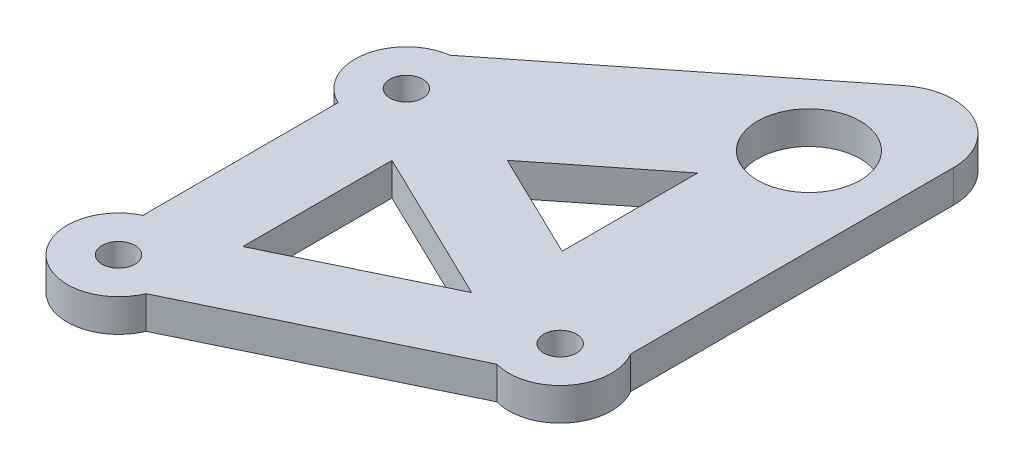
ISO-10303-21;
HEADER;
FILE_DESCRIPTION(('STEP AP214'),'2;1');
FILE_NAME('part.step','',(''),(''),'','','');
FILE_SCHEMA(('AUTOMOTIVE_DESIGN { 1 0 10303 214 1 1 1 1 }'));
ENDSEC;
DATA;
#1=APPLICATION_CONTEXT('core data for automotive mechanical design processes');
#2=APPLICATION_PROTOCOL_DEFINITION('international standard','automotive_design',2000,#1);
#3=PRODUCT_CONTEXT('',#1,'mechanical');
#4=PRODUCT('Part','Part','',(#3));
#5=PRODUCT_RELATED_PRODUCT_CATEGORY('part','',(#4));
#6=PRODUCT_DEFINITION_FORMATION('','',#4);
#7=PRODUCT_DEFINITION_CONTEXT('part definition',#1,'design');
#8=PRODUCT_DEFINITION('design','',#6,#7);
#9=PRODUCT_DEFINITION_SHAPE('','',#8);
#10=(LENGTH_UNIT() NAMED_UNIT(*) SI_UNIT(.MILLI.,.METRE.));
#11=(NAMED_UNIT(*) PLANE_ANGLE_UNIT() SI_UNIT($,.RADIAN.));
#12=(NAMED_UNIT(*) SI_UNIT($,.STERADIAN.) SOLID_ANGLE_UNIT());
#13=UNCERTAINTY_MEASURE_WITH_UNIT(LENGTH_MEASURE(1.E-05),#10,'distance_accuracy_value','');
#14=(GEOMETRIC_REPRESENTATION_CONTEXT(3) GLOBAL_UNCERTAINTY_ASSIGNED_CONTEXT((#13)) GLOBAL_UNIT_ASSIGNED_CONTEXT((#10,
#11,#12)) REPRESENTATION_CONTEXT('',''));
#15=CARTESIAN_POINT('',(0.,0.,0.));
#16=DIRECTION('',(0.,0.,1.));
#17=DIRECTION('',(1.,0.,0.));
#18=AXIS2_PLACEMENT_3D('',#15,#16,#17);
#19=CARTESIAN_POINT('',(-14.5,0.,-14.02));
#20=DIRECTION('',(0.,1.,0.));
#21=DIRECTION('',(0.,0.,1.));
#22=AXIS2_PLACEMENT_3D('',#19,#20,#21);
#23=PLANE('',#22);
#24=CARTESIAN_POINT('',(14.5,0.,0.));
#25=DIRECTION('',(0.,1.,0.));
#26=DIRECTION('',(0.,0.,1.));
#27=AXIS2_PLACEMENT_3D('',#24,#25,#26);
#28=CIRCLE('',#27,1.6);
#29=CARTESIAN_POINT('',(14.5,0.,1.6));
#30=VERTEX_POINT('',#29);
#31=EDGE_CURVE('E402',#30,#30,#28,.T.);
#32=ORIENTED_EDGE('',*,*,#31,.T.);
#33=EDGE_LOOP('',(#32));
#34=FACE_BOUND('',#33,.T.);
#35=CARTESIAN_POINT('',(-14.5,0.,14.02));
#36=DIRECTION('',(0.,1.,0.));
#37=DIRECTION('',(0.,0.,1.));
#38=AXIS2_PLACEMENT_3D('',#35,#36,#37);
#39=CIRCLE('',#38,1.6);
#40=CARTESIAN_POINT('',(-14.5,0.,15.62));
#41=VERTEX_POINT('',#40);
#42=EDGE_CURVE('E412',#41,#41,#39,.T.);
#43=ORIENTED_EDGE('',*,*,#42,.T.);
#44=EDGE_LOOP('',(#43));
#45=FACE_BOUND('',#44,.T.);
#46=CARTESIAN_POINT('',(-14.5,0.,-14.02));
#47=DIRECTION('',(0.,1.,0.));
#48=DIRECTION('',(0.,0.,1.));
#49=AXIS2_PLACEMENT_3D('',#46,#47,#48);
#50=CIRCLE('',#49,1.6);
#51=CARTESIAN_POINT('',(-14.5,0.,-12.42));
#52=VERTEX_POINT('',#51);
#53=EDGE_CURVE('E170',#52,#52,#50,.T.);
#54=ORIENTED_EDGE('',*,*,#53,.T.);
#55=EDGE_LOOP('',(#54));
#56=FACE_BOUND('',#55,.T.);
#57=DIRECTION('',(0.,0.,1.));
#58=VECTOR('',#57,1.);
#59=CARTESIAN_POINT('',(-9.148706396828,0.,7.26768697275068));
#60=LINE('',#59,#58);
#61=CARTESIAN_POINT('',(-9.148706396828,0.,-7.26768697275068));
#62=VERTEX_POINT('',#61);
#63=CARTESIAN_POINT('',(-9.148706396828,0.,7.26768697275068));
#64=VERTEX_POINT('',#63);
#65=EDGE_CURVE('E158',#62,#64,#60,.T.);
#66=ORIENTED_EDGE('',*,*,#65,.T.);
#67=DIRECTION('',(0.900308403633243,0.,-0.435252545480623));
#68=VECTOR('',#67,1.);
#69=CARTESIAN_POINT('',(-9.148706396828,0.,7.26768697275068));
#70=LINE('',#69,#68);
#71=CARTESIAN_POINT('',(5.88431230572332,0.,0.));
#72=VERTEX_POINT('',#71);
#73=EDGE_CURVE('E195',#64,#72,#70,.T.);
#74=ORIENTED_EDGE('',*,*,#73,.T.);
#75=DIRECTION('',(-0.900308403633243,0.,-0.435252545480623));
#76=VECTOR('',#75,1.);
#77=CARTESIAN_POINT('',(-9.148706396828,0.,-7.26768697275068));
#78=LINE('',#77,#76);
#79=EDGE_CURVE('E184',#72,#62,#78,.T.);
#80=ORIENTED_EDGE('',*,*,#79,.T.);
#81=EDGE_LOOP('',(#66,#74,#80));
#82=FACE_BOUND('',#81,.T.);
#83=CARTESIAN_POINT('',(-14.5,0.,-14.02));
#84=DIRECTION('',(0.,1.,0.));
#85=DIRECTION('',(0.,0.,1.));
#86=AXIS2_PLACEMENT_3D('',#83,#84,#85);
#87=CIRCLE('',#86,5.);
#88=CARTESIAN_POINT('',(-15.1859355739881,0.,-18.9727257533946));
#89=VERTEX_POINT('',#88);
#90=CARTESIAN_POINT('',(-16.648706396828,0.,-9.50523967189504));
#91=VERTEX_POINT('',#90);
#92=EDGE_CURVE('E212',#89,#91,#87,.T.);
#93=ORIENTED_EDGE('',*,*,#92,.F.);
#94=DIRECTION('',(-0.78372304879793,0.,0.621110443305276));
#95=VECTOR('',#94,1.);
#96=CARTESIAN_POINT('',(-15.1859355739881,0.,-18.9727257533946));
#97=LINE('',#96,#95);
#98=CARTESIAN_POINT('',(9.48849844955789,0.,-38.5275272590765));
#99=VERTEX_POINT('',#98);
#100=EDGE_CURVE('E218',#99,#89,#97,.T.);
#101=ORIENTED_EDGE('',*,*,#100,.F.);
#102=CARTESIAN_POINT('',(13.0590113124706,0.,-34.0222202611731));
#103=DIRECTION('',(0.,1.,0.));
#104=DIRECTION('',(0.,0.,-1.));
#105=AXIS2_PLACEMENT_3D('',#102,#103,#104);
#106=CIRCLE('',#105,5.74859576327843);
#107=CARTESIAN_POINT('',(18.807607075749,0.,-34.0222202611731));
#108=VERTEX_POINT('',#107);
#109=EDGE_CURVE('E258',#108,#99,#106,.T.);
#110=ORIENTED_EDGE('',*,*,#109,.F.);
#111=DIRECTION('',(0.,0.,-1.));
#112=VECTOR('',#111,1.);
#113=CARTESIAN_POINT('',(18.807607075749,0.,-2.53860616893544));
#114=LINE('',#113,#112);
#115=CARTESIAN_POINT('',(18.807607075749,0.,-2.53860616893544));
#116=VERTEX_POINT('',#115);
#117=EDGE_CURVE('E255',#116,#108,#114,.T.);
#118=ORIENTED_EDGE('',*,*,#117,.F.);
#119=CARTESIAN_POINT('',(14.5,0.,0.));
#120=DIRECTION('',(0.,1.,0.));
#121=DIRECTION('',(0.,0.,1.));
#122=AXIS2_PLACEMENT_3D('',#119,#120,#121);
#123=CIRCLE('',#122,5.);
#124=CARTESIAN_POINT('',(13.1547068714584,0.,4.81561900468661));
#125=VERTEX_POINT('',#124);
#126=EDGE_CURVE('E252',#125,#116,#123,.T.);
#127=ORIENTED_EDGE('',*,*,#126,.F.);
#128=DIRECTION('',(0.900308403633243,0.,-0.435252545480623));
#129=VECTOR('',#128,1.);
#130=CARTESIAN_POINT('',(13.1547068714584,0.,4.81561900468661));
#131=LINE('',#130,#129);
#132=CARTESIAN_POINT('',(-9.89031278035376,0.,15.9566940225627));
#133=VERTEX_POINT('',#132);
#134=EDGE_CURVE('E249',#133,#125,#131,.T.);
#135=ORIENTED_EDGE('',*,*,#134,.F.);
#136=CARTESIAN_POINT('',(-14.5,0.,14.02));
#137=DIRECTION('',(0.,1.,0.));
#138=DIRECTION('',(0.,0.,1.));
#139=AXIS2_PLACEMENT_3D('',#136,#137,#138);
#140=CIRCLE('',#139,5.);
#141=CARTESIAN_POINT('',(-16.648706396828,0.,9.50523967189503));
#142=VERTEX_POINT('',#141);
#143=EDGE_CURVE('E246',#142,#133,#140,.T.);
#144=ORIENTED_EDGE('',*,*,#143,.F.);
#145=DIRECTION('',(0.,0.,1.));
#146=VECTOR('',#145,1.);
#147=CARTESIAN_POINT('',(-16.648706396828,0.,9.50523967189504));
#148=LINE('',#147,#146);
#149=EDGE_CURVE('E243',#91,#142,#148,.T.);
#150=ORIENTED_EDGE('',*,*,#149,.F.);
#151=EDGE_LOOP('',(#93,#101,#110,#118,#127,#135,#144,#150));
#152=FACE_BOUND('',#151,.T.);
#153=DIRECTION('',(-0.78372304879793,0.,0.621110443305277));
#154=VECTOR('',#153,1.);
#155=CARTESIAN_POINT('',(-3.54321298464433,0.,-12.8881995696025));
#156=LINE('',#155,#154);
#157=CARTESIAN_POINT('',(6.80760707574901,0.,-21.0913555775122));
#158=VERTEX_POINT('',#157);
#159=CARTESIAN_POINT('',(-3.54321298464433,0.,-12.8881995696025));
#160=VERTEX_POINT('',#159);
#161=EDGE_CURVE('E63',#158,#160,#156,.T.);
#162=ORIENTED_EDGE('',*,*,#161,.T.);
#163=DIRECTION('',(0.900308403633243,0.,0.435252545480623));
#164=VECTOR('',#163,1.);
#165=CARTESIAN_POINT('',(-3.54321298464433,0.,-12.8881995696025));
#166=LINE('',#165,#164);
#167=CARTESIAN_POINT('',(6.80760707574901,0.,-7.88411345764682));
#168=VERTEX_POINT('',#167);
#169=EDGE_CURVE('E156',#160,#168,#166,.T.);
#170=ORIENTED_EDGE('',*,*,#169,.T.);
#171=DIRECTION('',(0.,0.,-1.));
#172=VECTOR('',#171,1.);
#173=CARTESIAN_POINT('',(6.80760707574901,0.,-7.88411345764682));
#174=LINE('',#173,#172);
#175=EDGE_CURVE('E151',#168,#158,#174,.T.);
#176=ORIENTED_EDGE('',*,*,#175,.T.);
#177=EDGE_LOOP('',(#162,#170,#176));
#178=FACE_BOUND('',#177,.T.);
#179=CARTESIAN_POINT('',(10.3380717056092,0.,-28.3940284923442));
#180=DIRECTION('',(0.,-1.,0.));
#181=DIRECTION('',(0.,0.,-1.));
#182=AXIS2_PLACEMENT_3D('',#179,#180,#181);
#183=CIRCLE('',#182,5.);
#184=CARTESIAN_POINT('',(10.3380717056092,0.,-33.3940284923442));
#185=VERTEX_POINT('',#184);
#186=EDGE_CURVE('E392',#185,#185,#183,.T.);
#187=ORIENTED_EDGE('',*,*,#186,.F.);
#188=EDGE_LOOP('',(#187));
#189=FACE_BOUND('',#188,.T.);
#190=ADVANCED_FACE('F39',(#34,#45,#56,#82,#152,#178,#189),#23,.F.);
#191=CARTESIAN_POINT('',(-14.5,3.18,-14.02));
#192=DIRECTION('',(0.,1.,0.));
#193=DIRECTION('',(0.,0.,1.));
#194=AXIS2_PLACEMENT_3D('',#191,#192,#193);
#195=PLANE('',#194);
#196=CARTESIAN_POINT('',(10.3380717056092,3.18,-28.3940284923442));
#197=DIRECTION('',(0.,1.,0.));
#198=DIRECTION('',(0.,0.,1.));
#199=AXIS2_PLACEMENT_3D('',#196,#197,#198);
#200=CIRCLE('',#199,5.);
#201=CARTESIAN_POINT('',(10.3380717056092,3.18,-23.3940284923442));
#202=VERTEX_POINT('',#201);
#203=EDGE_CURVE('E395',#202,#202,#200,.T.);
#204=ORIENTED_EDGE('',*,*,#203,.F.);
#205=EDGE_LOOP('',(#204));
#206=FACE_BOUND('',#205,.T.);
#207=CARTESIAN_POINT('',(14.5,3.18,0.));
#208=DIRECTION('',(0.,1.,0.));
#209=DIRECTION('',(0.,0.,1.));
#210=AXIS2_PLACEMENT_3D('',#207,#208,#209);
#211=CIRCLE('',#210,1.6);
#212=CARTESIAN_POINT('',(14.5,3.18,1.6));
#213=VERTEX_POINT('',#212);
#214=EDGE_CURVE('E397',#213,#213,#211,.T.);
#215=ORIENTED_EDGE('',*,*,#214,.F.);
#216=EDGE_LOOP('',(#215));
#217=FACE_BOUND('',#216,.T.);
#218=CARTESIAN_POINT('',(-14.5,3.18,14.02));
#219=DIRECTION('',(0.,1.,0.));
#220=DIRECTION('',(0.,0.,1.));
#221=AXIS2_PLACEMENT_3D('',#218,#219,#220);
#222=CIRCLE('',#221,1.6);
#223=CARTESIAN_POINT('',(-14.5,3.18,15.62));
#224=VERTEX_POINT('',#223);
#225=EDGE_CURVE('E408',#224,#224,#222,.T.);
#226=ORIENTED_EDGE('',*,*,#225,.F.);
#227=EDGE_LOOP('',(#226));
#228=FACE_BOUND('',#227,.T.);
#229=CARTESIAN_POINT('',(-14.5,3.18,-14.02));
#230=DIRECTION('',(0.,1.,0.));
#231=DIRECTION('',(0.,0.,1.));
#232=AXIS2_PLACEMENT_3D('',#229,#230,#231);
#233=CIRCLE('',#232,1.6);
#234=CARTESIAN_POINT('',(-14.5,3.18,-12.42));
#235=VERTEX_POINT('',#234);
#236=EDGE_CURVE('E416',#235,#235,#233,.T.);
#237=ORIENTED_EDGE('',*,*,#236,.F.);
#238=EDGE_LOOP('',(#237));
#239=FACE_BOUND('',#238,.T.);
#240=CARTESIAN_POINT('',(-14.5,3.18,-14.02));
#241=DIRECTION('',(0.,1.,0.));
#242=DIRECTION('',(0.,0.,1.));
#243=AXIS2_PLACEMENT_3D('',#240,#241,#242);
#244=CIRCLE('',#243,5.);
#245=CARTESIAN_POINT('',(-15.1859355739881,3.18,-18.9727257533946));
#246=VERTEX_POINT('',#245);
#247=CARTESIAN_POINT('',(-16.648706396828,3.18,-9.50523967189504));
#248=VERTEX_POINT('',#247);
#249=EDGE_CURVE('E213',#246,#248,#244,.T.);
#250=ORIENTED_EDGE('',*,*,#249,.T.);
#251=DIRECTION('',(0.,0.,1.));
#252=VECTOR('',#251,1.);
#253=CARTESIAN_POINT('',(-16.648706396828,3.18,9.50523967189504));
#254=LINE('',#253,#252);
#255=CARTESIAN_POINT('',(-16.648706396828,3.18,9.50523967189503));
#256=VERTEX_POINT('',#255);
#257=EDGE_CURVE('E217',#248,#256,#254,.T.);
#258=ORIENTED_EDGE('',*,*,#257,.T.);
#259=CARTESIAN_POINT('',(-14.5,3.18,14.02));
#260=DIRECTION('',(0.,1.,0.));
#261=DIRECTION('',(0.,0.,1.));
#262=AXIS2_PLACEMENT_3D('',#259,#260,#261);
#263=CIRCLE('',#262,5.);
#264=CARTESIAN_POINT('',(-9.89031278035376,3.18,15.9566940225627));
#265=VERTEX_POINT('',#264);
#266=EDGE_CURVE('E221',#256,#265,#263,.T.);
#267=ORIENTED_EDGE('',*,*,#266,.T.);
#268=DIRECTION('',(0.900308403633243,0.,-0.435252545480623));
#269=VECTOR('',#268,1.);
#270=CARTESIAN_POINT('',(13.1547068714584,3.18,4.81561900468661));
#271=LINE('',#270,#269);
#272=CARTESIAN_POINT('',(13.1547068714584,3.18,4.81561900468661));
#273=VERTEX_POINT('',#272);
#274=EDGE_CURVE('E224',#265,#273,#271,.T.);
#275=ORIENTED_EDGE('',*,*,#274,.T.);
#276=CARTESIAN_POINT('',(14.5,3.18,0.));
#277=DIRECTION('',(0.,1.,0.));
#278=DIRECTION('',(0.,0.,1.));
#279=AXIS2_PLACEMENT_3D('',#276,#277,#278);
#280=CIRCLE('',#279,5.);
#281=CARTESIAN_POINT('',(18.807607075749,3.18,-2.53860616893544));
#282=VERTEX_POINT('',#281);
#283=EDGE_CURVE('E227',#273,#282,#280,.T.);
#284=ORIENTED_EDGE('',*,*,#283,.T.);
#285=DIRECTION('',(0.,0.,-1.));
#286=VECTOR('',#285,1.);
#287=CARTESIAN_POINT('',(18.807607075749,3.18,-2.53860616893544));
#288=LINE('',#287,#286);
#289=CARTESIAN_POINT('',(18.807607075749,3.18,-34.0222202611731));
#290=VERTEX_POINT('',#289);
#291=EDGE_CURVE('E230',#282,#290,#288,.T.);
#292=ORIENTED_EDGE('',*,*,#291,.T.);
#293=CARTESIAN_POINT('',(13.0590113124706,3.18,-34.0222202611731));
#294=DIRECTION('',(0.,1.,0.));
#295=DIRECTION('',(0.,0.,-1.));
#296=AXIS2_PLACEMENT_3D('',#293,#294,#295);
#297=CIRCLE('',#296,5.74859576327843);
#298=CARTESIAN_POINT('',(9.48849844955789,3.18,-38.5275272590765));
#299=VERTEX_POINT('',#298);
#300=EDGE_CURVE('E233',#290,#299,#297,.T.);
#301=ORIENTED_EDGE('',*,*,#300,.T.);
#302=DIRECTION('',(-0.78372304879793,0.,0.621110443305276));
#303=VECTOR('',#302,1.);
#304=CARTESIAN_POINT('',(-15.1859355739881,3.18,-18.9727257533946));
#305=LINE('',#304,#303);
#306=EDGE_CURVE('E236',#299,#246,#305,.T.);
#307=ORIENTED_EDGE('',*,*,#306,.T.);
#308=EDGE_LOOP('',(#250,#258,#267,#275,#284,#292,#301,#307));
#309=FACE_BOUND('',#308,.T.);
#310=DIRECTION('',(0.900308403633243,0.,-0.435252545480623));
#311=VECTOR('',#310,1.);
#312=CARTESIAN_POINT('',(-9.148706396828,3.18,7.26768697275068));
#313=LINE('',#312,#311);
#314=CARTESIAN_POINT('',(-9.148706396828,3.18,7.26768697275068));
#315=VERTEX_POINT('',#314);
#316=CARTESIAN_POINT('',(5.88431230572332,3.18,0.));
#317=VERTEX_POINT('',#316);
#318=EDGE_CURVE('E183',#315,#317,#313,.T.);
#319=ORIENTED_EDGE('',*,*,#318,.F.);
#320=DIRECTION('',(0.,0.,1.));
#321=VECTOR('',#320,1.);
#322=CARTESIAN_POINT('',(-9.148706396828,3.18,7.26768697275068));
#323=LINE('',#322,#321);
#324=CARTESIAN_POINT('',(-9.148706396828,3.18,-7.26768697275068));
#325=VERTEX_POINT('',#324);
#326=EDGE_CURVE('E180',#325,#315,#323,.T.);
#327=ORIENTED_EDGE('',*,*,#326,.F.);
#328=DIRECTION('',(-0.900308403633243,0.,-0.435252545480623));
#329=VECTOR('',#328,1.);
#330=CARTESIAN_POINT('',(-9.148706396828,3.18,-7.26768697275068));
#331=LINE('',#330,#329);
#332=EDGE_CURVE('E188',#317,#325,#331,.T.);
#333=ORIENTED_EDGE('',*,*,#332,.F.);
#334=EDGE_LOOP('',(#319,#327,#333));
#335=FACE_BOUND('',#334,.T.);
#336=DIRECTION('',(0.900308403633243,0.,0.435252545480623));
#337=VECTOR('',#336,1.);
#338=CARTESIAN_POINT('',(-3.54321298464433,3.18,-12.8881995696025));
#339=LINE('',#338,#337);
#340=CARTESIAN_POINT('',(-3.54321298464433,3.18,-12.8881995696025));
#341=VERTEX_POINT('',#340);
#342=CARTESIAN_POINT('',(6.80760707574901,3.18,-7.88411345764682));
#343=VERTEX_POINT('',#342);
#344=EDGE_CURVE('E150',#341,#343,#339,.T.);
#345=ORIENTED_EDGE('',*,*,#344,.F.);
#346=DIRECTION('',(-0.78372304879793,0.,0.621110443305277));
#347=VECTOR('',#346,1.);
#348=CARTESIAN_POINT('',(-3.54321298464433,3.18,-12.8881995696025));
#349=LINE('',#348,#347);
#350=CARTESIAN_POINT('',(6.80760707574901,3.18,-21.0913555775122));
#351=VERTEX_POINT('',#350);
#352=EDGE_CURVE('E141',#351,#341,#349,.T.);
#353=ORIENTED_EDGE('',*,*,#352,.F.);
#354=DIRECTION('',(0.,0.,-1.));
#355=VECTOR('',#354,1.);
#356=CARTESIAN_POINT('',(6.80760707574901,3.18,-7.88411345764682));
#357=LINE('',#356,#355);
#358=EDGE_CURVE('E161',#343,#351,#357,.T.);
#359=ORIENTED_EDGE('',*,*,#358,.F.);
#360=EDGE_LOOP('',(#345,#353,#359));
#361=FACE_BOUND('',#360,.T.);
#362=ADVANCED_FACE('F160',(#206,#217,#228,#239,#309,#335,#361),#195,.T.);
#363=CARTESIAN_POINT('',(-14.5,3.18,-14.02));
#364=DIRECTION('',(0.,-1.,0.));
#365=DIRECTION('',(0.,0.,-1.));
#366=AXIS2_PLACEMENT_3D('',#363,#364,#365);
#367=CYLINDRICAL_SURFACE('',#366,5.);
#368=ORIENTED_EDGE('',*,*,#92,.T.);
#369=DIRECTION('',(0.,-1.,0.));
#370=VECTOR('',#369,1.);
#371=CARTESIAN_POINT('',(-16.648706396828,3.18,-9.50523967189504));
#372=LINE('',#371,#370);
#373=EDGE_CURVE('E11',#248,#91,#372,.T.);
#374=ORIENTED_EDGE('',*,*,#373,.F.);
#375=ORIENTED_EDGE('',*,*,#249,.F.);
#376=DIRECTION('',(0.,-1.,0.));
#377=VECTOR('',#376,1.);
#378=CARTESIAN_POINT('',(-15.1859355739881,3.18,-18.9727257533946));
#379=LINE('',#378,#377);
#380=EDGE_CURVE('E239',#246,#89,#379,.T.);
#381=ORIENTED_EDGE('',*,*,#380,.T.);
#382=EDGE_LOOP('',(#368,#374,#375,#381));
#383=FACE_BOUND('',#382,.T.);
#384=ADVANCED_FACE('F41',(#383),#367,.T.);
#385=CARTESIAN_POINT('',(-16.648706396828,3.18,9.50523967189504));
#386=DIRECTION('',(1.,0.,0.));
#387=DIRECTION('',(0.,0.,-1.));
#388=AXIS2_PLACEMENT_3D('',#385,#386,#387);
#389=PLANE('',#388);
#390=ORIENTED_EDGE('',*,*,#149,.T.);
#391=DIRECTION('',(0.,-1.,0.));
#392=VECTOR('',#391,1.);
#393=CARTESIAN_POINT('',(-16.648706396828,3.18,9.50523967189503));
#394=LINE('',#393,#392);
#395=EDGE_CURVE('E48',#256,#142,#394,.T.);
#396=ORIENTED_EDGE('',*,*,#395,.F.);
#397=ORIENTED_EDGE('',*,*,#257,.F.);
#398=ORIENTED_EDGE('',*,*,#373,.T.);
#399=EDGE_LOOP('',(#390,#396,#397,#398));
#400=FACE_BOUND('',#399,.T.);
#401=ADVANCED_FACE('F314',(#400),#389,.F.);
#402=CARTESIAN_POINT('',(-14.5,3.18,14.02));
#403=DIRECTION('',(0.,-1.,0.));
#404=DIRECTION('',(0.,0.,-1.));
#405=AXIS2_PLACEMENT_3D('',#402,#403,#404);
#406=CYLINDRICAL_SURFACE('',#405,5.);
#407=ORIENTED_EDGE('',*,*,#143,.T.);
#408=DIRECTION('',(0.,-1.,0.));
#409=VECTOR('',#408,1.);
#410=CARTESIAN_POINT('',(-9.89031278035376,3.18,15.9566940225627));
#411=LINE('',#410,#409);
#412=EDGE_CURVE('E282',#265,#133,#411,.T.);
#413=ORIENTED_EDGE('',*,*,#412,.F.);
#414=ORIENTED_EDGE('',*,*,#266,.F.);
#415=ORIENTED_EDGE('',*,*,#395,.T.);
#416=EDGE_LOOP('',(#407,#413,#414,#415));
#417=FACE_BOUND('',#416,.T.);
#418=ADVANCED_FACE('F291',(#417),#406,.T.);
#419=CARTESIAN_POINT('',(13.1547068714584,3.18,4.81561900468661));
#420=DIRECTION('',(-0.435252545480623,0.,-0.900308403633243));
#421=DIRECTION('',(-0.900308403633243,0.,0.435252545480623));
#422=AXIS2_PLACEMENT_3D('',#419,#420,#421);
#423=PLANE('',#422);
#424=ORIENTED_EDGE('',*,*,#134,.T.);
#425=DIRECTION('',(0.,-1.,0.));
#426=VECTOR('',#425,1.);
#427=CARTESIAN_POINT('',(13.1547068714584,3.18,4.81561900468661));
#428=LINE('',#427,#426);
#429=EDGE_CURVE('E278',#273,#125,#428,.T.);
#430=ORIENTED_EDGE('',*,*,#429,.F.);
#431=ORIENTED_EDGE('',*,*,#274,.F.);
#432=ORIENTED_EDGE('',*,*,#412,.T.);
#433=EDGE_LOOP('',(#424,#430,#431,#432));
#434=FACE_BOUND('',#433,.T.);
#435=ADVANCED_FACE('F302',(#434),#423,.F.);
#436=CARTESIAN_POINT('',(14.5,3.18,0.));
#437=DIRECTION('',(0.,-1.,0.));
#438=DIRECTION('',(0.,0.,-1.));
#439=AXIS2_PLACEMENT_3D('',#436,#437,#438);
#440=CYLINDRICAL_SURFACE('',#439,5.);
#441=ORIENTED_EDGE('',*,*,#126,.T.);
#442=DIRECTION('',(0.,-1.,0.));
#443=VECTOR('',#442,1.);
#444=CARTESIAN_POINT('',(18.807607075749,3.18,-2.53860616893544));
#445=LINE('',#444,#443);
#446=EDGE_CURVE('E274',#282,#116,#445,.T.);
#447=ORIENTED_EDGE('',*,*,#446,.F.);
#448=ORIENTED_EDGE('',*,*,#283,.F.);
#449=ORIENTED_EDGE('',*,*,#429,.T.);
#450=EDGE_LOOP('',(#441,#447,#448,#449));
#451=FACE_BOUND('',#450,.T.);
#452=ADVANCED_FACE('F306',(#451),#440,.T.);
#453=CARTESIAN_POINT('',(18.807607075749,3.18,-2.53860616893544));
#454=DIRECTION('',(-1.,0.,0.));
#455=DIRECTION('',(0.,0.,1.));
#456=AXIS2_PLACEMENT_3D('',#453,#454,#455);
#457=PLANE('',#456);
#458=ORIENTED_EDGE('',*,*,#117,.T.);
#459=DIRECTION('',(0.,-1.,0.));
#460=VECTOR('',#459,1.);
#461=CARTESIAN_POINT('',(18.807607075749,3.18,-34.0222202611731));
#462=LINE('',#461,#460);
#463=EDGE_CURVE('E270',#290,#108,#462,.T.);
#464=ORIENTED_EDGE('',*,*,#463,.F.);
#465=ORIENTED_EDGE('',*,*,#291,.F.);
#466=ORIENTED_EDGE('',*,*,#446,.T.);
#467=EDGE_LOOP('',(#458,#464,#465,#466));
#468=FACE_BOUND('',#467,.T.);
#469=ADVANCED_FACE('F327',(#468),#457,.F.);
#470=CARTESIAN_POINT('',(13.0590113124706,3.18,-34.0222202611731));
#471=DIRECTION('',(0.,-1.,0.));
#472=DIRECTION('',(0.,0.,-1.));
#473=AXIS2_PLACEMENT_3D('',#470,#471,#472);
#474=CYLINDRICAL_SURFACE('',#473,5.74859576327843);
#475=ORIENTED_EDGE('',*,*,#109,.T.);
#476=DIRECTION('',(0.,-1.,0.));
#477=VECTOR('',#476,1.);
#478=CARTESIAN_POINT('',(9.48849844955789,3.18,-38.5275272590765));
#479=LINE('',#478,#477);
#480=EDGE_CURVE('E266',#299,#99,#479,.T.);
#481=ORIENTED_EDGE('',*,*,#480,.F.);
#482=ORIENTED_EDGE('',*,*,#300,.F.);
#483=ORIENTED_EDGE('',*,*,#463,.T.);
#484=EDGE_LOOP('',(#475,#481,#482,#483));
#485=FACE_BOUND('',#484,.T.);
#486=ADVANCED_FACE('F325',(#485),#474,.T.);
#487=CARTESIAN_POINT('',(-15.1859355739881,3.18,-18.9727257533946));
#488=DIRECTION('',(0.621110443305276,0.,0.78372304879793));
#489=DIRECTION('',(0.78372304879793,0.,-0.621110443305277));
#490=AXIS2_PLACEMENT_3D('',#487,#488,#489);
#491=PLANE('',#490);
#492=ORIENTED_EDGE('',*,*,#100,.T.);
#493=ORIENTED_EDGE('',*,*,#380,.F.);
#494=ORIENTED_EDGE('',*,*,#306,.F.);
#495=ORIENTED_EDGE('',*,*,#480,.T.);
#496=EDGE_LOOP('',(#492,#493,#494,#495));
#497=FACE_BOUND('',#496,.T.);
#498=ADVANCED_FACE('F320',(#497),#491,.F.);
#499=CARTESIAN_POINT('',(-9.148706396828,3.18,7.26768697275068));
#500=DIRECTION('',(1.,0.,0.));
#501=DIRECTION('',(0.,0.,-1.));
#502=AXIS2_PLACEMENT_3D('',#499,#500,#501);
#503=PLANE('',#502);
#504=ORIENTED_EDGE('',*,*,#65,.F.);
#505=DIRECTION('',(0.,-1.,0.));
#506=VECTOR('',#505,1.);
#507=CARTESIAN_POINT('',(-9.148706396828,3.18,-7.26768697275068));
#508=LINE('',#507,#506);
#509=EDGE_CURVE('E191',#325,#62,#508,.T.);
#510=ORIENTED_EDGE('',*,*,#509,.F.);
#511=ORIENTED_EDGE('',*,*,#326,.T.);
#512=DIRECTION('',(0.,-1.,0.));
#513=VECTOR('',#512,1.);
#514=CARTESIAN_POINT('',(-9.148706396828,3.18,7.26768697275068));
#515=LINE('',#514,#513);
#516=EDGE_CURVE('E208',#315,#64,#515,.T.);
#517=ORIENTED_EDGE('',*,*,#516,.T.);
#518=EDGE_LOOP('',(#504,#510,#511,#517));
#519=FACE_BOUND('',#518,.T.);
#520=ADVANCED_FACE('F349',(#519),#503,.T.);
#521=CARTESIAN_POINT('',(-9.148706396828,3.18,7.26768697275068));
#522=DIRECTION('',(-0.435252545480623,0.,-0.900308403633243));
#523=DIRECTION('',(-0.900308403633243,0.,0.435252545480623));
#524=AXIS2_PLACEMENT_3D('',#521,#522,#523);
#525=PLANE('',#524);
#526=ORIENTED_EDGE('',*,*,#73,.F.);
#527=ORIENTED_EDGE('',*,*,#516,.F.);
#528=ORIENTED_EDGE('',*,*,#318,.T.);
#529=DIRECTION('',(0.,-1.,0.));
#530=VECTOR('',#529,1.);
#531=CARTESIAN_POINT('',(5.88431230572332,3.18,0.));
#532=LINE('',#531,#530);
#533=EDGE_CURVE('E205',#317,#72,#532,.T.);
#534=ORIENTED_EDGE('',*,*,#533,.T.);
#535=EDGE_LOOP('',(#526,#527,#528,#534));
#536=FACE_BOUND('',#535,.T.);
#537=ADVANCED_FACE('F353',(#536),#525,.T.);
#538=CARTESIAN_POINT('',(-9.148706396828,3.18,-7.26768697275068));
#539=DIRECTION('',(-0.435252545480623,0.,0.900308403633243));
#540=DIRECTION('',(0.900308403633243,0.,0.435252545480623));
#541=AXIS2_PLACEMENT_3D('',#538,#539,#540);
#542=PLANE('',#541);
#543=ORIENTED_EDGE('',*,*,#79,.F.);
#544=ORIENTED_EDGE('',*,*,#533,.F.);
#545=ORIENTED_EDGE('',*,*,#332,.T.);
#546=ORIENTED_EDGE('',*,*,#509,.T.);
#547=EDGE_LOOP('',(#543,#544,#545,#546));
#548=FACE_BOUND('',#547,.T.);
#549=ADVANCED_FACE('F358',(#548),#542,.T.);
#550=CARTESIAN_POINT('',(-3.54321298464433,3.18,-12.8881995696025));
#551=DIRECTION('',(0.621110443305277,0.,0.78372304879793));
#552=DIRECTION('',(0.78372304879793,0.,-0.621110443305277));
#553=AXIS2_PLACEMENT_3D('',#550,#551,#552);
#554=PLANE('',#553);
#555=ORIENTED_EDGE('',*,*,#161,.F.);
#556=DIRECTION('',(0.,-1.,0.));
#557=VECTOR('',#556,1.);
#558=CARTESIAN_POINT('',(6.80760707574901,3.18,-21.0913555775122));
#559=LINE('',#558,#557);
#560=EDGE_CURVE('E145',#351,#158,#559,.T.);
#561=ORIENTED_EDGE('',*,*,#560,.F.);
#562=ORIENTED_EDGE('',*,*,#352,.T.);
#563=DIRECTION('',(0.,-1.,0.));
#564=VECTOR('',#563,1.);
#565=CARTESIAN_POINT('',(-3.54321298464433,3.18,-12.8881995696025));
#566=LINE('',#565,#564);
#567=EDGE_CURVE('E144',#341,#160,#566,.T.);
#568=ORIENTED_EDGE('',*,*,#567,.T.);
#569=EDGE_LOOP('',(#555,#561,#562,#568));
#570=FACE_BOUND('',#569,.T.);
#571=ADVANCED_FACE('F143',(#570),#554,.T.);
#572=CARTESIAN_POINT('',(-3.54321298464433,3.18,-12.8881995696025));
#573=DIRECTION('',(0.435252545480623,0.,-0.900308403633243));
#574=DIRECTION('',(-0.900308403633243,0.,-0.435252545480623));
#575=AXIS2_PLACEMENT_3D('',#572,#573,#574);
#576=PLANE('',#575);
#577=ORIENTED_EDGE('',*,*,#169,.F.);
#578=ORIENTED_EDGE('',*,*,#567,.F.);
#579=ORIENTED_EDGE('',*,*,#344,.T.);
#580=DIRECTION('',(0.,-1.,0.));
#581=VECTOR('',#580,1.);
#582=CARTESIAN_POINT('',(6.80760707574901,3.18,-7.88411345764682));
#583=LINE('',#582,#581);
#584=EDGE_CURVE('E55',#343,#168,#583,.T.);
#585=ORIENTED_EDGE('',*,*,#584,.T.);
#586=EDGE_LOOP('',(#577,#578,#579,#585));
#587=FACE_BOUND('',#586,.T.);
#588=ADVANCED_FACE('F154',(#587),#576,.T.);
#589=CARTESIAN_POINT('',(6.80760707574901,3.18,-7.88411345764682));
#590=DIRECTION('',(-1.,0.,0.));
#591=DIRECTION('',(0.,0.,1.));
#592=AXIS2_PLACEMENT_3D('',#589,#590,#591);
#593=PLANE('',#592);
#594=ORIENTED_EDGE('',*,*,#175,.F.);
#595=ORIENTED_EDGE('',*,*,#584,.F.);
#596=ORIENTED_EDGE('',*,*,#358,.T.);
#597=ORIENTED_EDGE('',*,*,#560,.T.);
#598=EDGE_LOOP('',(#594,#595,#596,#597));
#599=FACE_BOUND('',#598,.T.);
#600=ADVANCED_FACE('F369',(#599),#593,.T.);
#601=CARTESIAN_POINT('',(-14.5,3.18,-14.02));
#602=DIRECTION('',(0.,1.,0.));
#603=DIRECTION('',(0.,0.,1.));
#604=AXIS2_PLACEMENT_3D('',#601,#602,#603);
#605=CYLINDRICAL_SURFACE('',#604,1.6);
#606=ORIENTED_EDGE('',*,*,#53,.F.);
#607=EDGE_LOOP('',(#606));
#608=FACE_BOUND('',#607,.T.);
#609=ORIENTED_EDGE('',*,*,#236,.T.);
#610=EDGE_LOOP('',(#609));
#611=FACE_BOUND('',#610,.T.);
#612=ADVANCED_FACE('F372',(#608,#611),#605,.F.);
#613=CARTESIAN_POINT('',(-14.5,3.18,14.02));
#614=DIRECTION('',(0.,1.,0.));
#615=DIRECTION('',(0.,0.,1.));
#616=AXIS2_PLACEMENT_3D('',#613,#614,#615);
#617=CYLINDRICAL_SURFACE('',#616,1.6);
#618=ORIENTED_EDGE('',*,*,#42,.F.);
#619=EDGE_LOOP('',(#618));
#620=FACE_BOUND('',#619,.T.);
#621=ORIENTED_EDGE('',*,*,#225,.T.);
#622=EDGE_LOOP('',(#621));
#623=FACE_BOUND('',#622,.T.);
#624=ADVANCED_FACE('F375',(#620,#623),#617,.F.);
#625=CARTESIAN_POINT('',(14.5,3.18,0.));
#626=DIRECTION('',(0.,1.,0.));
#627=DIRECTION('',(0.,0.,1.));
#628=AXIS2_PLACEMENT_3D('',#625,#626,#627);
#629=CYLINDRICAL_SURFACE('',#628,1.6);
#630=ORIENTED_EDGE('',*,*,#31,.F.);
#631=EDGE_LOOP('',(#630));
#632=FACE_BOUND('',#631,.T.);
#633=ORIENTED_EDGE('',*,*,#214,.T.);
#634=EDGE_LOOP('',(#633));
#635=FACE_BOUND('',#634,.T.);
#636=ADVANCED_FACE('F379',(#632,#635),#629,.F.);
#637=CARTESIAN_POINT('',(10.3380717056092,0.,-28.3940284923442));
#638=DIRECTION('',(0.,-1.,0.));
#639=DIRECTION('',(0.,0.,-1.));
#640=AXIS2_PLACEMENT_3D('',#637,#638,#639);
#641=CYLINDRICAL_SURFACE('',#640,5.);
#642=ORIENTED_EDGE('',*,*,#186,.T.);
#643=EDGE_LOOP('',(#642));
#644=FACE_BOUND('',#643,.T.);
#645=ORIENTED_EDGE('',*,*,#203,.T.);
#646=EDGE_LOOP('',(#645));
#647=FACE_BOUND('',#646,.T.);
#648=ADVANCED_FACE('F383',(#644,#647),#641,.F.);
#649=CLOSED_SHELL('',(#190,#362,#384,#401,#418,#435,#452,#469,#486,#498,#520,#537,#549,#571,
#588,#600,#612,#624,#636,#648));
#650=MANIFOLD_SOLID_BREP('B2',#649);
#651=ADVANCED_BREP_SHAPE_REPRESENTATION('',(#18,#650),#14);
#652=SHAPE_DEFINITION_REPRESENTATION(#9,#651);
ENDSEC;
END-ISO-10303-21;
